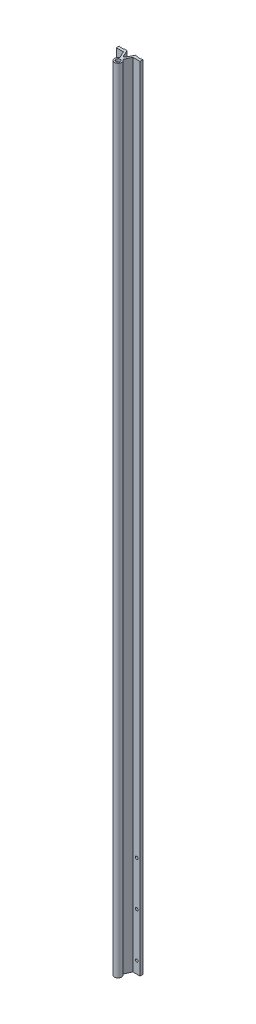
ISO-10303-21;
HEADER;
FILE_DESCRIPTION(('STEP AP214'),'2;1');
FILE_NAME('part.step','',(''),(''),'','','');
FILE_SCHEMA(('AUTOMOTIVE_DESIGN { 1 0 10303 214 1 1 1 1 }'));
ENDSEC;
DATA;
#1=APPLICATION_CONTEXT('core data for automotive mechanical design processes');
#2=APPLICATION_PROTOCOL_DEFINITION('international standard','automotive_design',2000,#1);
#3=PRODUCT_CONTEXT('',#1,'mechanical');
#4=PRODUCT('Part','Part','',(#3));
#5=PRODUCT_RELATED_PRODUCT_CATEGORY('part','',(#4));
#6=PRODUCT_DEFINITION_FORMATION('','',#4);
#7=PRODUCT_DEFINITION_CONTEXT('part definition',#1,'design');
#8=PRODUCT_DEFINITION('design','',#6,#7);
#9=PRODUCT_DEFINITION_SHAPE('','',#8);
#10=(LENGTH_UNIT() NAMED_UNIT(*) SI_UNIT(.MILLI.,.METRE.));
#11=(NAMED_UNIT(*) PLANE_ANGLE_UNIT() SI_UNIT($,.RADIAN.));
#12=(NAMED_UNIT(*) SI_UNIT($,.STERADIAN.) SOLID_ANGLE_UNIT());
#13=UNCERTAINTY_MEASURE_WITH_UNIT(LENGTH_MEASURE(1.E-05),#10,'distance_accuracy_value','');
#14=(GEOMETRIC_REPRESENTATION_CONTEXT(3) GLOBAL_UNCERTAINTY_ASSIGNED_CONTEXT((#13)) GLOBAL_UNIT_ASSIGNED_CONTEXT((#10,
#11,#12)) REPRESENTATION_CONTEXT('',''));
#15=CARTESIAN_POINT('',(0.,0.,0.));
#16=DIRECTION('',(0.,0.,1.));
#17=DIRECTION('',(1.,0.,0.));
#18=AXIS2_PLACEMENT_3D('',#15,#16,#17);
#19=CARTESIAN_POINT('',(0.,0.,-22.));
#20=DIRECTION('',(0.,0.,-1.));
#21=DIRECTION('',(-1.,0.,0.));
#22=AXIS2_PLACEMENT_3D('',#19,#20,#21);
#23=PLANE('',#22);
#24=DIRECTION('',(0.,1.,0.));
#25=VECTOR('',#24,1.);
#26=CARTESIAN_POINT('',(-20.,0.,-22.));
#27=LINE('',#26,#25);
#28=CARTESIAN_POINT('',(-20.,1146.,-22.));
#29=VERTEX_POINT('',#28);
#30=CARTESIAN_POINT('',(-20.,-190.,-22.));
#31=VERTEX_POINT('',#30);
#32=EDGE_CURVE('E212',#29,#31,#27,.F.);
#33=ORIENTED_EDGE('',*,*,#32,.F.);
#34=DIRECTION('',(1.,0.,0.));
#35=VECTOR('',#34,1.);
#36=CARTESIAN_POINT('',(-18.35,1146.,-22.));
#37=LINE('',#36,#35);
#38=CARTESIAN_POINT('',(-18.35,1146.,-22.));
#39=VERTEX_POINT('',#38);
#40=EDGE_CURVE('E884',#29,#39,#37,.T.);
#41=ORIENTED_EDGE('',*,*,#40,.T.);
#42=DIRECTION('',(0.,1.,0.));
#43=VECTOR('',#42,1.);
#44=CARTESIAN_POINT('',(-18.35,0.,-22.));
#45=LINE('',#44,#43);
#46=CARTESIAN_POINT('',(-18.35,-190.,-22.));
#47=VERTEX_POINT('',#46);
#48=EDGE_CURVE('E244',#39,#47,#45,.F.);
#49=ORIENTED_EDGE('',*,*,#48,.T.);
#50=DIRECTION('',(-1.,0.,0.));
#51=VECTOR('',#50,1.);
#52=CARTESIAN_POINT('',(0.,-190.,-22.));
#53=LINE('',#52,#51);
#54=EDGE_CURVE('E247',#47,#31,#53,.T.);
#55=ORIENTED_EDGE('',*,*,#54,.T.);
#56=EDGE_LOOP('',(#33,#41,#49,#55));
#57=FACE_BOUND('',#56,.T.);
#58=ADVANCED_FACE('F37',(#57),#23,.T.);
#59=CARTESIAN_POINT('',(-14.5,-170.,-19.5));
#60=DIRECTION('',(0.,0.,-1.));
#61=DIRECTION('',(-1.,0.,0.));
#62=AXIS2_PLACEMENT_3D('',#59,#60,#61);
#63=CYLINDRICAL_SURFACE('',#62,2.25);
#64=CARTESIAN_POINT('',(-14.5,-170.,-21.2));
#65=DIRECTION('',(0.,0.,-1.));
#66=DIRECTION('',(-1.,0.,0.));
#67=AXIS2_PLACEMENT_3D('',#64,#65,#66);
#68=CIRCLE('',#67,2.25);
#69=CARTESIAN_POINT('',(-16.75,-170.,-21.2));
#70=VERTEX_POINT('',#69);
#71=EDGE_CURVE('E215',#70,#70,#68,.T.);
#72=ORIENTED_EDGE('',*,*,#71,.T.);
#73=EDGE_LOOP('',(#72));
#74=FACE_BOUND('',#73,.T.);
#75=CARTESIAN_POINT('',(-14.5,-170.,-17.));
#76=DIRECTION('',(0.,0.,-1.));
#77=DIRECTION('',(-1.,0.,0.));
#78=AXIS2_PLACEMENT_3D('',#75,#76,#77);
#79=CIRCLE('',#78,2.25);
#80=CARTESIAN_POINT('',(-16.75,-170.,-17.));
#81=VERTEX_POINT('',#80);
#82=EDGE_CURVE('E40',#81,#81,#79,.T.);
#83=ORIENTED_EDGE('',*,*,#82,.F.);
#84=EDGE_LOOP('',(#83));
#85=FACE_BOUND('',#84,.T.);
#86=ADVANCED_FACE('F309',(#74,#85),#63,.F.);
#87=CARTESIAN_POINT('',(-14.5,-95.,-19.5));
#88=DIRECTION('',(0.,0.,-1.));
#89=DIRECTION('',(-1.,0.,0.));
#90=AXIS2_PLACEMENT_3D('',#87,#88,#89);
#91=CYLINDRICAL_SURFACE('',#90,2.25);
#92=CARTESIAN_POINT('',(-14.5,-95.,-21.2));
#93=DIRECTION('',(0.,0.,-1.));
#94=DIRECTION('',(-1.,0.,0.));
#95=AXIS2_PLACEMENT_3D('',#92,#93,#94);
#96=CIRCLE('',#95,2.25);
#97=CARTESIAN_POINT('',(-16.75,-95.,-21.2));
#98=VERTEX_POINT('',#97);
#99=EDGE_CURVE('E294',#98,#98,#96,.T.);
#100=ORIENTED_EDGE('',*,*,#99,.T.);
#101=EDGE_LOOP('',(#100));
#102=FACE_BOUND('',#101,.T.);
#103=CARTESIAN_POINT('',(-14.5,-95.,-17.));
#104=DIRECTION('',(0.,0.,-1.));
#105=DIRECTION('',(-1.,0.,0.));
#106=AXIS2_PLACEMENT_3D('',#103,#104,#105);
#107=CIRCLE('',#106,2.25);
#108=CARTESIAN_POINT('',(-16.75,-95.,-17.));
#109=VERTEX_POINT('',#108);
#110=EDGE_CURVE('E300',#109,#109,#107,.T.);
#111=ORIENTED_EDGE('',*,*,#110,.F.);
#112=EDGE_LOOP('',(#111));
#113=FACE_BOUND('',#112,.T.);
#114=ADVANCED_FACE('F311',(#102,#113),#91,.F.);
#115=CARTESIAN_POINT('',(-14.5,-20.,-19.5));
#116=DIRECTION('',(0.,0.,-1.));
#117=DIRECTION('',(-1.,0.,0.));
#118=AXIS2_PLACEMENT_3D('',#115,#116,#117);
#119=CYLINDRICAL_SURFACE('',#118,2.25);
#120=CARTESIAN_POINT('',(-14.5,-20.,-21.2));
#121=DIRECTION('',(0.,0.,-1.));
#122=DIRECTION('',(-1.,0.,0.));
#123=AXIS2_PLACEMENT_3D('',#120,#121,#122);
#124=CIRCLE('',#123,2.25);
#125=CARTESIAN_POINT('',(-16.75,-20.,-21.2));
#126=VERTEX_POINT('',#125);
#127=EDGE_CURVE('E265',#126,#126,#124,.T.);
#128=ORIENTED_EDGE('',*,*,#127,.T.);
#129=EDGE_LOOP('',(#128));
#130=FACE_BOUND('',#129,.T.);
#131=CARTESIAN_POINT('',(-14.5,-20.,-17.));
#132=DIRECTION('',(0.,0.,-1.));
#133=DIRECTION('',(-1.,0.,0.));
#134=AXIS2_PLACEMENT_3D('',#131,#132,#133);
#135=CIRCLE('',#134,2.25);
#136=CARTESIAN_POINT('',(-16.75,-20.,-17.));
#137=VERTEX_POINT('',#136);
#138=EDGE_CURVE('E229',#137,#137,#135,.T.);
#139=ORIENTED_EDGE('',*,*,#138,.F.);
#140=EDGE_LOOP('',(#139));
#141=FACE_BOUND('',#140,.T.);
#142=ADVANCED_FACE('F317',(#130,#141),#119,.F.);
#143=CARTESIAN_POINT('',(-18.35,0.,-22.));
#144=DIRECTION('',(-0.707106781186548,0.,0.707106781186548));
#145=DIRECTION('',(0.707106781186548,0.,0.707106781186548));
#146=AXIS2_PLACEMENT_3D('',#143,#144,#145);
#147=PLANE('',#146);
#148=ORIENTED_EDGE('',*,*,#48,.F.);
#149=DIRECTION('',(0.707106781186549,0.,0.707106781186546));
#150=VECTOR('',#149,1.);
#151=CARTESIAN_POINT('',(-17.55,1146.,-21.2));
#152=LINE('',#151,#150);
#153=CARTESIAN_POINT('',(-17.55,1146.,-21.2));
#154=VERTEX_POINT('',#153);
#155=EDGE_CURVE('E876',#39,#154,#152,.T.);
#156=ORIENTED_EDGE('',*,*,#155,.T.);
#157=DIRECTION('',(0.,1.,0.));
#158=VECTOR('',#157,1.);
#159=CARTESIAN_POINT('',(-17.55,0.,-21.2));
#160=LINE('',#159,#158);
#161=CARTESIAN_POINT('',(-17.55,-190.,-21.2));
#162=VERTEX_POINT('',#161);
#163=EDGE_CURVE('E207',#154,#162,#160,.F.);
#164=ORIENTED_EDGE('',*,*,#163,.T.);
#165=DIRECTION('',(0.707106781186548,0.,0.707106781186548));
#166=VECTOR('',#165,1.);
#167=CARTESIAN_POINT('',(-18.35,-190.,-22.));
#168=LINE('',#167,#166);
#169=EDGE_CURVE('E116',#47,#162,#168,.T.);
#170=ORIENTED_EDGE('',*,*,#169,.F.);
#171=EDGE_LOOP('',(#148,#156,#164,#170));
#172=FACE_BOUND('',#171,.T.);
#173=ADVANCED_FACE('F409',(#172),#147,.F.);
#174=CARTESIAN_POINT('',(-11.45,0.,-21.2));
#175=DIRECTION('',(0.707106781186548,0.,0.707106781186548));
#176=DIRECTION('',(0.707106781186548,0.,-0.707106781186548));
#177=AXIS2_PLACEMENT_3D('',#174,#175,#176);
#178=PLANE('',#177);
#179=DIRECTION('',(0.,1.,0.));
#180=VECTOR('',#179,1.);
#181=CARTESIAN_POINT('',(-11.45,0.,-21.2));
#182=LINE('',#181,#180);
#183=CARTESIAN_POINT('',(-11.45,-190.,-21.2));
#184=VERTEX_POINT('',#183);
#185=CARTESIAN_POINT('',(-11.45,1146.,-21.2));
#186=VERTEX_POINT('',#185);
#187=EDGE_CURVE('E211',#184,#186,#182,.T.);
#188=ORIENTED_EDGE('',*,*,#187,.T.);
#189=DIRECTION('',(0.707106781186547,0.,-0.707106781186548));
#190=VECTOR('',#189,1.);
#191=CARTESIAN_POINT('',(-10.65,1146.,-22.));
#192=LINE('',#191,#190);
#193=CARTESIAN_POINT('',(-10.65,1146.,-22.));
#194=VERTEX_POINT('',#193);
#195=EDGE_CURVE('E968',#186,#194,#192,.T.);
#196=ORIENTED_EDGE('',*,*,#195,.T.);
#197=DIRECTION('',(0.,1.,0.));
#198=VECTOR('',#197,1.);
#199=CARTESIAN_POINT('',(-10.65,0.,-22.));
#200=LINE('',#199,#198);
#201=CARTESIAN_POINT('',(-10.65,-190.,-22.));
#202=VERTEX_POINT('',#201);
#203=EDGE_CURVE('E195',#202,#194,#200,.T.);
#204=ORIENTED_EDGE('',*,*,#203,.F.);
#205=DIRECTION('',(0.707106781186548,0.,-0.707106781186548));
#206=VECTOR('',#205,1.);
#207=CARTESIAN_POINT('',(-11.45,-190.,-21.2));
#208=LINE('',#207,#206);
#209=EDGE_CURVE('E108',#184,#202,#208,.T.);
#210=ORIENTED_EDGE('',*,*,#209,.F.);
#211=EDGE_LOOP('',(#188,#196,#204,#210));
#212=FACE_BOUND('',#211,.T.);
#213=ADVANCED_FACE('F405',(#212),#178,.F.);
#214=CARTESIAN_POINT('',(17.55,0.,-21.2));
#215=DIRECTION('',(0.707106781186548,0.,0.707106781186548));
#216=DIRECTION('',(0.707106781186548,0.,-0.707106781186548));
#217=AXIS2_PLACEMENT_3D('',#214,#215,#216);
#218=PLANE('',#217);
#219=DIRECTION('',(0.,1.,0.));
#220=VECTOR('',#219,1.);
#221=CARTESIAN_POINT('',(17.55,0.,-21.2));
#222=LINE('',#221,#220);
#223=CARTESIAN_POINT('',(17.55,-190.,-21.2));
#224=VERTEX_POINT('',#223);
#225=CARTESIAN_POINT('',(17.55,1146.,-21.2));
#226=VERTEX_POINT('',#225);
#227=EDGE_CURVE('E176',#224,#226,#222,.T.);
#228=ORIENTED_EDGE('',*,*,#227,.T.);
#229=DIRECTION('',(0.707106781186548,0.,-0.707106781186548));
#230=VECTOR('',#229,1.);
#231=CARTESIAN_POINT('',(18.35,1146.,-22.));
#232=LINE('',#231,#230);
#233=CARTESIAN_POINT('',(18.35,1146.,-22.));
#234=VERTEX_POINT('',#233);
#235=EDGE_CURVE('E946',#226,#234,#232,.T.);
#236=ORIENTED_EDGE('',*,*,#235,.T.);
#237=DIRECTION('',(0.,1.,0.));
#238=VECTOR('',#237,1.);
#239=CARTESIAN_POINT('',(18.35,0.,-22.));
#240=LINE('',#239,#238);
#241=CARTESIAN_POINT('',(18.35,-190.,-22.));
#242=VERTEX_POINT('',#241);
#243=EDGE_CURVE('E233',#242,#234,#240,.T.);
#244=ORIENTED_EDGE('',*,*,#243,.F.);
#245=DIRECTION('',(0.707106781186548,0.,-0.707106781186548));
#246=VECTOR('',#245,1.);
#247=CARTESIAN_POINT('',(17.55,-190.,-21.2));
#248=LINE('',#247,#246);
#249=EDGE_CURVE('E239',#224,#242,#248,.T.);
#250=ORIENTED_EDGE('',*,*,#249,.F.);
#251=EDGE_LOOP('',(#228,#236,#244,#250));
#252=FACE_BOUND('',#251,.T.);
#253=ADVANCED_FACE('F401',(#252),#218,.F.);
#254=CARTESIAN_POINT('',(10.65,0.,-22.));
#255=DIRECTION('',(-0.707106781186548,0.,0.707106781186548));
#256=DIRECTION('',(0.707106781186548,0.,0.707106781186548));
#257=AXIS2_PLACEMENT_3D('',#254,#255,#256);
#258=PLANE('',#257);
#259=DIRECTION('',(0.,1.,0.));
#260=VECTOR('',#259,1.);
#261=CARTESIAN_POINT('',(10.65,0.,-22.));
#262=LINE('',#261,#260);
#263=CARTESIAN_POINT('',(10.65,1146.,-22.));
#264=VERTEX_POINT('',#263);
#265=CARTESIAN_POINT('',(10.65,-190.,-22.));
#266=VERTEX_POINT('',#265);
#267=EDGE_CURVE('E177',#264,#266,#262,.F.);
#268=ORIENTED_EDGE('',*,*,#267,.F.);
#269=DIRECTION('',(0.707106781186548,0.,0.707106781186548));
#270=VECTOR('',#269,1.);
#271=CARTESIAN_POINT('',(11.45,1146.,-21.2));
#272=LINE('',#271,#270);
#273=CARTESIAN_POINT('',(11.45,1146.,-21.2));
#274=VERTEX_POINT('',#273);
#275=EDGE_CURVE('E952',#264,#274,#272,.T.);
#276=ORIENTED_EDGE('',*,*,#275,.T.);
#277=DIRECTION('',(0.,1.,0.));
#278=VECTOR('',#277,1.);
#279=CARTESIAN_POINT('',(11.45,0.,-21.2));
#280=LINE('',#279,#278);
#281=CARTESIAN_POINT('',(11.45,-190.,-21.2));
#282=VERTEX_POINT('',#281);
#283=EDGE_CURVE('E171',#274,#282,#280,.F.);
#284=ORIENTED_EDGE('',*,*,#283,.T.);
#285=DIRECTION('',(0.707106781186548,0.,0.707106781186548));
#286=VECTOR('',#285,1.);
#287=CARTESIAN_POINT('',(10.65,-190.,-22.));
#288=LINE('',#287,#286);
#289=EDGE_CURVE('E236',#266,#282,#288,.T.);
#290=ORIENTED_EDGE('',*,*,#289,.F.);
#291=EDGE_LOOP('',(#268,#276,#284,#290));
#292=FACE_BOUND('',#291,.T.);
#293=ADVANCED_FACE('F397',(#292),#258,.F.);
#294=CARTESIAN_POINT('',(0.,0.,-22.));
#295=DIRECTION('',(0.,0.,-1.));
#296=DIRECTION('',(-1.,0.,0.));
#297=AXIS2_PLACEMENT_3D('',#294,#295,#296);
#298=PLANE('',#297);
#299=DIRECTION('',(0.,1.,0.));
#300=VECTOR('',#299,1.);
#301=CARTESIAN_POINT('',(20.,0.,-22.));
#302=LINE('',#301,#300);
#303=CARTESIAN_POINT('',(20.,-190.,-22.));
#304=VERTEX_POINT('',#303);
#305=CARTESIAN_POINT('',(20.,1146.,-22.));
#306=VERTEX_POINT('',#305);
#307=EDGE_CURVE('E168',#304,#306,#302,.T.);
#308=ORIENTED_EDGE('',*,*,#307,.F.);
#309=DIRECTION('',(-1.,0.,0.));
#310=VECTOR('',#309,1.);
#311=CARTESIAN_POINT('',(0.,-190.,-22.));
#312=LINE('',#311,#310);
#313=EDGE_CURVE('E156',#304,#242,#312,.T.);
#314=ORIENTED_EDGE('',*,*,#313,.T.);
#315=ORIENTED_EDGE('',*,*,#243,.T.);
#316=DIRECTION('',(1.,0.,0.));
#317=VECTOR('',#316,1.);
#318=CARTESIAN_POINT('',(20.,1146.,-22.));
#319=LINE('',#318,#317);
#320=EDGE_CURVE('E941',#234,#306,#319,.T.);
#321=ORIENTED_EDGE('',*,*,#320,.T.);
#322=EDGE_LOOP('',(#308,#314,#315,#321));
#323=FACE_BOUND('',#322,.T.);
#324=ADVANCED_FACE('F393',(#323),#298,.T.);
#325=CARTESIAN_POINT('',(14.5,-170.,-19.5));
#326=DIRECTION('',(0.,0.,-1.));
#327=DIRECTION('',(-1.,0.,0.));
#328=AXIS2_PLACEMENT_3D('',#325,#326,#327);
#329=CYLINDRICAL_SURFACE('',#328,2.25);
#330=CARTESIAN_POINT('',(14.5,-170.,-17.));
#331=DIRECTION('',(0.,0.,-1.));
#332=DIRECTION('',(-1.,0.,0.));
#333=AXIS2_PLACEMENT_3D('',#330,#331,#332);
#334=CIRCLE('',#333,2.25);
#335=CARTESIAN_POINT('',(12.25,-170.,-17.));
#336=VERTEX_POINT('',#335);
#337=EDGE_CURVE('E170',#336,#336,#334,.T.);
#338=ORIENTED_EDGE('',*,*,#337,.F.);
#339=EDGE_LOOP('',(#338));
#340=FACE_BOUND('',#339,.T.);
#341=CARTESIAN_POINT('',(14.5,-170.,-21.2));
#342=DIRECTION('',(0.,0.,-1.));
#343=DIRECTION('',(-1.,0.,0.));
#344=AXIS2_PLACEMENT_3D('',#341,#342,#343);
#345=CIRCLE('',#344,2.25);
#346=CARTESIAN_POINT('',(12.25,-170.,-21.2));
#347=VERTEX_POINT('',#346);
#348=EDGE_CURVE('E190',#347,#347,#345,.T.);
#349=ORIENTED_EDGE('',*,*,#348,.T.);
#350=EDGE_LOOP('',(#349));
#351=FACE_BOUND('',#350,.T.);
#352=ADVANCED_FACE('F389',(#340,#351),#329,.F.);
#353=CARTESIAN_POINT('',(14.5,-95.,-19.5));
#354=DIRECTION('',(0.,0.,-1.));
#355=DIRECTION('',(-1.,0.,0.));
#356=AXIS2_PLACEMENT_3D('',#353,#354,#355);
#357=CYLINDRICAL_SURFACE('',#356,2.25);
#358=CARTESIAN_POINT('',(14.5,-95.,-17.));
#359=DIRECTION('',(0.,0.,-1.));
#360=DIRECTION('',(-1.,0.,0.));
#361=AXIS2_PLACEMENT_3D('',#358,#359,#360);
#362=CIRCLE('',#361,2.25);
#363=CARTESIAN_POINT('',(12.25,-95.,-17.));
#364=VERTEX_POINT('',#363);
#365=EDGE_CURVE('E280',#364,#364,#362,.T.);
#366=ORIENTED_EDGE('',*,*,#365,.F.);
#367=EDGE_LOOP('',(#366));
#368=FACE_BOUND('',#367,.T.);
#369=CARTESIAN_POINT('',(14.5,-95.,-21.2));
#370=DIRECTION('',(0.,0.,-1.));
#371=DIRECTION('',(-1.,0.,0.));
#372=AXIS2_PLACEMENT_3D('',#369,#370,#371);
#373=CIRCLE('',#372,2.25);
#374=CARTESIAN_POINT('',(12.25,-95.,-21.2));
#375=VERTEX_POINT('',#374);
#376=EDGE_CURVE('E287',#375,#375,#373,.T.);
#377=ORIENTED_EDGE('',*,*,#376,.T.);
#378=EDGE_LOOP('',(#377));
#379=FACE_BOUND('',#378,.T.);
#380=ADVANCED_FACE('F385',(#368,#379),#357,.F.);
#381=CARTESIAN_POINT('',(14.5,-20.,-19.5));
#382=DIRECTION('',(0.,0.,-1.));
#383=DIRECTION('',(-1.,0.,0.));
#384=AXIS2_PLACEMENT_3D('',#381,#382,#383);
#385=CYLINDRICAL_SURFACE('',#384,2.25);
#386=CARTESIAN_POINT('',(14.5,-20.,-17.));
#387=DIRECTION('',(0.,0.,-1.));
#388=DIRECTION('',(-1.,0.,0.));
#389=AXIS2_PLACEMENT_3D('',#386,#387,#388);
#390=CIRCLE('',#389,2.25);
#391=CARTESIAN_POINT('',(12.25,-20.,-17.));
#392=VERTEX_POINT('',#391);
#393=EDGE_CURVE('E143',#392,#392,#390,.T.);
#394=ORIENTED_EDGE('',*,*,#393,.F.);
#395=EDGE_LOOP('',(#394));
#396=FACE_BOUND('',#395,.T.);
#397=CARTESIAN_POINT('',(14.5,-20.,-21.2));
#398=DIRECTION('',(0.,0.,-1.));
#399=DIRECTION('',(-1.,0.,0.));
#400=AXIS2_PLACEMENT_3D('',#397,#398,#399);
#401=CIRCLE('',#400,2.25);
#402=CARTESIAN_POINT('',(12.25,-20.,-21.2));
#403=VERTEX_POINT('',#402);
#404=EDGE_CURVE('E259',#403,#403,#401,.T.);
#405=ORIENTED_EDGE('',*,*,#404,.T.);
#406=EDGE_LOOP('',(#405));
#407=FACE_BOUND('',#406,.T.);
#408=ADVANCED_FACE('F381',(#396,#407),#385,.F.);
#409=CARTESIAN_POINT('',(0.,-95.,0.));
#410=DIRECTION('',(0.,-1.,0.));
#411=DIRECTION('',(0.,0.,-1.));
#412=AXIS2_PLACEMENT_3D('',#409,#410,#411);
#413=CYLINDRICAL_SURFACE('',#412,3.5);
#414=CARTESIAN_POINT('',(0.,-190.,0.));
#415=DIRECTION('',(0.,-1.,0.));
#416=DIRECTION('',(0.,0.,-1.));
#417=AXIS2_PLACEMENT_3D('',#414,#415,#416);
#418=CIRCLE('',#417,3.5);
#419=CARTESIAN_POINT('',(0.,-190.,-3.5));
#420=VERTEX_POINT('',#419);
#421=EDGE_CURVE('E274',#420,#420,#418,.F.);
#422=ORIENTED_EDGE('',*,*,#421,.F.);
#423=EDGE_LOOP('',(#422));
#424=FACE_BOUND('',#423,.T.);
#425=CARTESIAN_POINT('',(0.,1146.,0.));
#426=DIRECTION('',(0.,-1.,0.));
#427=DIRECTION('',(0.,0.,-1.));
#428=AXIS2_PLACEMENT_3D('',#425,#426,#427);
#429=CIRCLE('',#428,3.5);
#430=CARTESIAN_POINT('',(0.,1146.,-3.5));
#431=VERTEX_POINT('',#430);
#432=EDGE_CURVE('E249',#431,#431,#429,.T.);
#433=ORIENTED_EDGE('',*,*,#432,.F.);
#434=EDGE_LOOP('',(#433));
#435=FACE_BOUND('',#434,.T.);
#436=ADVANCED_FACE('F377',(#424,#435),#413,.F.);
#437=CARTESIAN_POINT('',(-7.92723018863498,0.,-17.));
#438=DIRECTION('',(-0.90630778703665,0.,0.4226182617407));
#439=DIRECTION('',(0.4226182617407,0.,0.90630778703665));
#440=AXIS2_PLACEMENT_3D('',#437,#438,#439);
#441=PLANE('',#440);
#442=DIRECTION('',(0.,1.,0.));
#443=VECTOR('',#442,1.);
#444=CARTESIAN_POINT('',(-7.92723018863498,0.,-17.));
#445=LINE('',#444,#443);
#446=CARTESIAN_POINT('',(-7.92723018863498,-190.,-17.));
#447=VERTEX_POINT('',#446);
#448=CARTESIAN_POINT('',(-7.92723018863498,1146.,-17.));
#449=VERTEX_POINT('',#448);
#450=EDGE_CURVE('E219',#447,#449,#445,.T.);
#451=ORIENTED_EDGE('',*,*,#450,.F.);
#452=DIRECTION('',(-0.422618261740699,0.,-0.90630778703665));
#453=VECTOR('',#452,1.);
#454=CARTESIAN_POINT('',(-2.5357095704442,-190.,-5.4378467222199));
#455=LINE('',#454,#453);
#456=CARTESIAN_POINT('',(-2.5357095704442,-190.,-5.4378467222199));
#457=VERTEX_POINT('',#456);
#458=EDGE_CURVE('E224',#457,#447,#455,.T.);
#459=ORIENTED_EDGE('',*,*,#458,.F.);
#460=DIRECTION('',(0.,1.,0.));
#461=VECTOR('',#460,1.);
#462=CARTESIAN_POINT('',(-2.5357095704442,-95.,-5.4378467222199));
#463=LINE('',#462,#461);
#464=CARTESIAN_POINT('',(-2.5357095704442,1146.,-5.4378467222199));
#465=VERTEX_POINT('',#464);
#466=EDGE_CURVE('E277',#465,#457,#463,.F.);
#467=ORIENTED_EDGE('',*,*,#466,.F.);
#468=DIRECTION('',(-0.4226182617407,0.,-0.90630778703665));
#469=VECTOR('',#468,1.);
#470=CARTESIAN_POINT('',(-7.92723018863498,1146.,-17.));
#471=LINE('',#470,#469);
#472=EDGE_CURVE('E899',#465,#449,#471,.T.);
#473=ORIENTED_EDGE('',*,*,#472,.T.);
#474=EDGE_LOOP('',(#451,#459,#467,#473));
#475=FACE_BOUND('',#474,.T.);
#476=ADVANCED_FACE('F373',(#475),#441,.T.);
#477=CARTESIAN_POINT('',(-20.,0.,-17.));
#478=DIRECTION('',(0.,0.,1.));
#479=DIRECTION('',(1.,0.,0.));
#480=AXIS2_PLACEMENT_3D('',#477,#478,#479);
#481=PLANE('',#480);
#482=ORIENTED_EDGE('',*,*,#450,.T.);
#483=DIRECTION('',(-1.,0.,0.));
#484=VECTOR('',#483,1.);
#485=CARTESIAN_POINT('',(-20.,1146.,-17.));
#486=LINE('',#485,#484);
#487=CARTESIAN_POINT('',(-20.,1146.,-17.));
#488=VERTEX_POINT('',#487);
#489=EDGE_CURVE('E893',#449,#488,#486,.T.);
#490=ORIENTED_EDGE('',*,*,#489,.T.);
#491=DIRECTION('',(0.,1.,0.));
#492=VECTOR('',#491,1.);
#493=CARTESIAN_POINT('',(-20.,0.,-17.));
#494=LINE('',#493,#492);
#495=CARTESIAN_POINT('',(-20.,-190.,-17.));
#496=VERTEX_POINT('',#495);
#497=EDGE_CURVE('E216',#496,#488,#494,.T.);
#498=ORIENTED_EDGE('',*,*,#497,.F.);
#499=DIRECTION('',(1.,0.,0.));
#500=VECTOR('',#499,1.);
#501=CARTESIAN_POINT('',(0.,-190.,-17.));
#502=LINE('',#501,#500);
#503=EDGE_CURVE('E220',#447,#496,#502,.F.);
#504=ORIENTED_EDGE('',*,*,#503,.F.);
#505=EDGE_LOOP('',(#482,#490,#498,#504));
#506=FACE_BOUND('',#505,.T.);
#507=ORIENTED_EDGE('',*,*,#138,.T.);
#508=EDGE_LOOP('',(#507));
#509=FACE_BOUND('',#508,.T.);
#510=ORIENTED_EDGE('',*,*,#110,.T.);
#511=EDGE_LOOP('',(#510));
#512=FACE_BOUND('',#511,.T.);
#513=ORIENTED_EDGE('',*,*,#82,.T.);
#514=EDGE_LOOP('',(#513));
#515=FACE_BOUND('',#514,.T.);
#516=ADVANCED_FACE('F307',(#506,#509,#512,#515),#481,.T.);
#517=CARTESIAN_POINT('',(-20.,0.,-22.));
#518=DIRECTION('',(-1.,0.,0.));
#519=DIRECTION('',(0.,0.,1.));
#520=AXIS2_PLACEMENT_3D('',#517,#518,#519);
#521=PLANE('',#520);
#522=ORIENTED_EDGE('',*,*,#497,.T.);
#523=DIRECTION('',(0.,0.,-1.));
#524=VECTOR('',#523,1.);
#525=CARTESIAN_POINT('',(-20.,1146.,-22.));
#526=LINE('',#525,#524);
#527=EDGE_CURVE('E891',#488,#29,#526,.T.);
#528=ORIENTED_EDGE('',*,*,#527,.T.);
#529=ORIENTED_EDGE('',*,*,#32,.T.);
#530=DIRECTION('',(0.,0.,-1.));
#531=VECTOR('',#530,1.);
#532=CARTESIAN_POINT('',(-20.,-190.,-16.1592701804792));
#533=LINE('',#532,#531);
#534=EDGE_CURVE('E223',#496,#31,#533,.T.);
#535=ORIENTED_EDGE('',*,*,#534,.F.);
#536=EDGE_LOOP('',(#522,#528,#529,#535));
#537=FACE_BOUND('',#536,.T.);
#538=ADVANCED_FACE('F366',(#537),#521,.T.);
#539=CARTESIAN_POINT('',(-17.55,0.,-21.2));
#540=DIRECTION('',(0.,0.,1.));
#541=DIRECTION('',(1.,0.,0.));
#542=AXIS2_PLACEMENT_3D('',#539,#540,#541);
#543=PLANE('',#542);
#544=ORIENTED_EDGE('',*,*,#163,.F.);
#545=DIRECTION('',(1.,0.,0.));
#546=VECTOR('',#545,1.);
#547=CARTESIAN_POINT('',(-11.45,1146.,-21.2));
#548=LINE('',#547,#546);
#549=EDGE_CURVE('E888',#154,#186,#548,.T.);
#550=ORIENTED_EDGE('',*,*,#549,.T.);
#551=ORIENTED_EDGE('',*,*,#187,.F.);
#552=DIRECTION('',(1.,0.,0.));
#553=VECTOR('',#552,1.);
#554=CARTESIAN_POINT('',(0.,-190.,-21.2));
#555=LINE('',#554,#553);
#556=EDGE_CURVE('E202',#162,#184,#555,.T.);
#557=ORIENTED_EDGE('',*,*,#556,.F.);
#558=EDGE_LOOP('',(#544,#550,#551,#557));
#559=FACE_BOUND('',#558,.T.);
#560=ORIENTED_EDGE('',*,*,#127,.F.);
#561=EDGE_LOOP('',(#560));
#562=FACE_BOUND('',#561,.T.);
#563=ORIENTED_EDGE('',*,*,#99,.F.);
#564=EDGE_LOOP('',(#563));
#565=FACE_BOUND('',#564,.T.);
#566=ORIENTED_EDGE('',*,*,#71,.F.);
#567=EDGE_LOOP('',(#566));
#568=FACE_BOUND('',#567,.T.);
#569=ADVANCED_FACE('F363',(#559,#562,#565,#568),#543,.F.);
#570=CARTESIAN_POINT('',(0.,0.,-22.));
#571=DIRECTION('',(0.,0.,-1.));
#572=DIRECTION('',(-1.,0.,0.));
#573=AXIS2_PLACEMENT_3D('',#570,#571,#572);
#574=PLANE('',#573);
#575=DIRECTION('',(0.,1.,0.));
#576=VECTOR('',#575,1.);
#577=CARTESIAN_POINT('',(-6.83917898627331,0.,-22.));
#578=LINE('',#577,#576);
#579=CARTESIAN_POINT('',(-6.83917898627331,1146.,-22.));
#580=VERTEX_POINT('',#579);
#581=CARTESIAN_POINT('',(-6.83917898627331,-190.,-22.));
#582=VERTEX_POINT('',#581);
#583=EDGE_CURVE('E79',#580,#582,#578,.F.);
#584=ORIENTED_EDGE('',*,*,#583,.T.);
#585=DIRECTION('',(1.,0.,0.));
#586=VECTOR('',#585,1.);
#587=CARTESIAN_POINT('',(0.,-190.,-22.));
#588=LINE('',#587,#586);
#589=EDGE_CURVE('E198',#202,#582,#588,.T.);
#590=ORIENTED_EDGE('',*,*,#589,.F.);
#591=ORIENTED_EDGE('',*,*,#203,.T.);
#592=DIRECTION('',(1.,0.,0.));
#593=VECTOR('',#592,1.);
#594=CARTESIAN_POINT('',(-6.83917898627331,1146.,-22.));
#595=LINE('',#594,#593);
#596=EDGE_CURVE('E966',#194,#580,#595,.T.);
#597=ORIENTED_EDGE('',*,*,#596,.T.);
#598=EDGE_LOOP('',(#584,#590,#591,#597));
#599=FACE_BOUND('',#598,.T.);
#600=ADVANCED_FACE('F360',(#599),#574,.T.);
#601=CARTESIAN_POINT('',(-4.50764069549832,0.,-17.));
#602=DIRECTION('',(-0.90630778703665,0.,0.4226182617407));
#603=DIRECTION('',(0.4226182617407,0.,0.90630778703665));
#604=AXIS2_PLACEMENT_3D('',#601,#602,#603);
#605=PLANE('',#604);
#606=ORIENTED_EDGE('',*,*,#583,.F.);
#607=DIRECTION('',(0.422618261740699,0.,0.90630778703665));
#608=VECTOR('',#607,1.);
#609=CARTESIAN_POINT('',(-1.70979474656833,1146.,-11.));
#610=LINE('',#609,#608);
#611=CARTESIAN_POINT('',(-1.70979474656833,1146.,-11.));
#612=VERTEX_POINT('',#611);
#613=EDGE_CURVE('E964',#580,#612,#610,.T.);
#614=ORIENTED_EDGE('',*,*,#613,.T.);
#615=DIRECTION('',(0.,1.,0.));
#616=VECTOR('',#615,1.);
#617=CARTESIAN_POINT('',(-1.70979474656832,0.,-11.));
#618=LINE('',#617,#616);
#619=CARTESIAN_POINT('',(-1.70979474656833,-190.,-11.));
#620=VERTEX_POINT('',#619);
#621=EDGE_CURVE('E68',#612,#620,#618,.F.);
#622=ORIENTED_EDGE('',*,*,#621,.T.);
#623=DIRECTION('',(0.422618261740699,0.,0.90630778703665));
#624=VECTOR('',#623,1.);
#625=CARTESIAN_POINT('',(-6.83917898627331,-190.,-22.));
#626=LINE('',#625,#624);
#627=EDGE_CURVE('E201',#582,#620,#626,.T.);
#628=ORIENTED_EDGE('',*,*,#627,.F.);
#629=EDGE_LOOP('',(#606,#614,#622,#628));
#630=FACE_BOUND('',#629,.T.);
#631=ADVANCED_FACE('F356',(#630),#605,.F.);
#632=CARTESIAN_POINT('',(0.,0.,-11.797290384198));
#633=DIRECTION('',(0.,1.,0.));
#634=DIRECTION('',(0.,0.,1.));
#635=AXIS2_PLACEMENT_3D('',#632,#633,#634);
#636=CYLINDRICAL_SURFACE('',#635,1.88654976932156);
#637=ORIENTED_EDGE('',*,*,#621,.F.);
#638=CARTESIAN_POINT('',(0.,1146.,-11.797290384198));
#639=DIRECTION('',(0.,-1.,0.));
#640=DIRECTION('',(0.,0.,-1.));
#641=AXIS2_PLACEMENT_3D('',#638,#639,#640);
#642=CIRCLE('',#641,1.88654976932157);
#643=CARTESIAN_POINT('',(1.70979474656833,1146.,-11.));
#644=VERTEX_POINT('',#643);
#645=EDGE_CURVE('E961',#612,#644,#642,.F.);
#646=ORIENTED_EDGE('',*,*,#645,.T.);
#647=DIRECTION('',(0.,1.,0.));
#648=VECTOR('',#647,1.);
#649=CARTESIAN_POINT('',(1.70979474656833,0.,-11.));
#650=LINE('',#649,#648);
#651=CARTESIAN_POINT('',(1.70979474656833,-190.,-11.));
#652=VERTEX_POINT('',#651);
#653=EDGE_CURVE('E181',#644,#652,#650,.F.);
#654=ORIENTED_EDGE('',*,*,#653,.T.);
#655=CARTESIAN_POINT('',(0.,-190.,-11.797290384198));
#656=DIRECTION('',(0.,1.,0.));
#657=DIRECTION('',(0.,0.,1.));
#658=AXIS2_PLACEMENT_3D('',#655,#656,#657);
#659=CIRCLE('',#658,1.88654976932156);
#660=EDGE_CURVE('E271',#620,#652,#659,.T.);
#661=ORIENTED_EDGE('',*,*,#660,.F.);
#662=EDGE_LOOP('',(#637,#646,#654,#661));
#663=FACE_BOUND('',#662,.T.);
#664=ADVANCED_FACE('F352',(#663),#636,.F.);
#665=CARTESIAN_POINT('',(1.70979474656833,0.,-11.));
#666=DIRECTION('',(0.90630778703665,0.,0.4226182617407));
#667=DIRECTION('',(0.4226182617407,0.,-0.90630778703665));
#668=AXIS2_PLACEMENT_3D('',#665,#666,#667);
#669=PLANE('',#668);
#670=ORIENTED_EDGE('',*,*,#653,.F.);
#671=DIRECTION('',(0.422618261740699,0.,-0.90630778703665));
#672=VECTOR('',#671,1.);
#673=CARTESIAN_POINT('',(6.83917898627331,1146.,-22.));
#674=LINE('',#673,#672);
#675=CARTESIAN_POINT('',(6.83917898627331,1146.,-22.));
#676=VERTEX_POINT('',#675);
#677=EDGE_CURVE('E958',#644,#676,#674,.T.);
#678=ORIENTED_EDGE('',*,*,#677,.T.);
#679=DIRECTION('',(0.,1.,0.));
#680=VECTOR('',#679,1.);
#681=CARTESIAN_POINT('',(6.83917898627331,0.,-22.));
#682=LINE('',#681,#680);
#683=CARTESIAN_POINT('',(6.83917898627331,-190.,-22.));
#684=VERTEX_POINT('',#683);
#685=EDGE_CURVE('E180',#684,#676,#682,.T.);
#686=ORIENTED_EDGE('',*,*,#685,.F.);
#687=DIRECTION('',(0.422618261740699,0.,-0.90630778703665));
#688=VECTOR('',#687,1.);
#689=CARTESIAN_POINT('',(1.70979474656833,-190.,-11.));
#690=LINE('',#689,#688);
#691=EDGE_CURVE('E185',#652,#684,#690,.T.);
#692=ORIENTED_EDGE('',*,*,#691,.F.);
#693=EDGE_LOOP('',(#670,#678,#686,#692));
#694=FACE_BOUND('',#693,.T.);
#695=ADVANCED_FACE('F348',(#694),#669,.F.);
#696=CARTESIAN_POINT('',(0.,0.,-22.));
#697=DIRECTION('',(0.,0.,-1.));
#698=DIRECTION('',(-1.,0.,0.));
#699=AXIS2_PLACEMENT_3D('',#696,#697,#698);
#700=PLANE('',#699);
#701=ORIENTED_EDGE('',*,*,#685,.T.);
#702=DIRECTION('',(1.,0.,0.));
#703=VECTOR('',#702,1.);
#704=CARTESIAN_POINT('',(10.65,1146.,-22.));
#705=LINE('',#704,#703);
#706=EDGE_CURVE('E955',#676,#264,#705,.T.);
#707=ORIENTED_EDGE('',*,*,#706,.T.);
#708=ORIENTED_EDGE('',*,*,#267,.T.);
#709=DIRECTION('',(1.,0.,0.));
#710=VECTOR('',#709,1.);
#711=CARTESIAN_POINT('',(0.,-190.,-22.));
#712=LINE('',#711,#710);
#713=EDGE_CURVE('E161',#684,#266,#712,.T.);
#714=ORIENTED_EDGE('',*,*,#713,.F.);
#715=EDGE_LOOP('',(#701,#707,#708,#714));
#716=FACE_BOUND('',#715,.T.);
#717=ADVANCED_FACE('F344',(#716),#700,.T.);
#718=CARTESIAN_POINT('',(11.45,0.,-21.2));
#719=DIRECTION('',(0.,0.,1.));
#720=DIRECTION('',(1.,0.,0.));
#721=AXIS2_PLACEMENT_3D('',#718,#719,#720);
#722=PLANE('',#721);
#723=ORIENTED_EDGE('',*,*,#283,.F.);
#724=DIRECTION('',(1.,0.,0.));
#725=VECTOR('',#724,1.);
#726=CARTESIAN_POINT('',(17.55,1146.,-21.2));
#727=LINE('',#726,#725);
#728=EDGE_CURVE('E949',#274,#226,#727,.T.);
#729=ORIENTED_EDGE('',*,*,#728,.T.);
#730=ORIENTED_EDGE('',*,*,#227,.F.);
#731=DIRECTION('',(1.,0.,0.));
#732=VECTOR('',#731,1.);
#733=CARTESIAN_POINT('',(0.,-190.,-21.2));
#734=LINE('',#733,#732);
#735=EDGE_CURVE('E158',#282,#224,#734,.T.);
#736=ORIENTED_EDGE('',*,*,#735,.F.);
#737=EDGE_LOOP('',(#723,#729,#730,#736));
#738=FACE_BOUND('',#737,.T.);
#739=ORIENTED_EDGE('',*,*,#404,.F.);
#740=EDGE_LOOP('',(#739));
#741=FACE_BOUND('',#740,.T.);
#742=ORIENTED_EDGE('',*,*,#376,.F.);
#743=EDGE_LOOP('',(#742));
#744=FACE_BOUND('',#743,.T.);
#745=ORIENTED_EDGE('',*,*,#348,.F.);
#746=EDGE_LOOP('',(#745));
#747=FACE_BOUND('',#746,.T.);
#748=ADVANCED_FACE('F341',(#738,#741,#744,#747),#722,.F.);
#749=CARTESIAN_POINT('',(20.,0.,-17.));
#750=DIRECTION('',(1.,0.,0.));
#751=DIRECTION('',(0.,0.,-1.));
#752=AXIS2_PLACEMENT_3D('',#749,#750,#751);
#753=PLANE('',#752);
#754=ORIENTED_EDGE('',*,*,#307,.T.);
#755=DIRECTION('',(0.,0.,1.));
#756=VECTOR('',#755,1.);
#757=CARTESIAN_POINT('',(20.,1146.,-17.));
#758=LINE('',#757,#756);
#759=CARTESIAN_POINT('',(20.,1146.,-17.));
#760=VERTEX_POINT('',#759);
#761=EDGE_CURVE('E138',#306,#760,#758,.T.);
#762=ORIENTED_EDGE('',*,*,#761,.T.);
#763=DIRECTION('',(0.,1.,0.));
#764=VECTOR('',#763,1.);
#765=CARTESIAN_POINT('',(20.,0.,-17.));
#766=LINE('',#765,#764);
#767=CARTESIAN_POINT('',(20.,-190.,-17.));
#768=VERTEX_POINT('',#767);
#769=EDGE_CURVE('E130',#768,#760,#766,.T.);
#770=ORIENTED_EDGE('',*,*,#769,.F.);
#771=DIRECTION('',(0.,0.,-1.));
#772=VECTOR('',#771,1.);
#773=CARTESIAN_POINT('',(20.,-190.,-16.1592701804792));
#774=LINE('',#773,#772);
#775=EDGE_CURVE('E135',#304,#768,#774,.F.);
#776=ORIENTED_EDGE('',*,*,#775,.F.);
#777=EDGE_LOOP('',(#754,#762,#770,#776));
#778=FACE_BOUND('',#777,.T.);
#779=ADVANCED_FACE('F133',(#778),#753,.T.);
#780=CARTESIAN_POINT('',(7.92723018863498,0.,-17.));
#781=DIRECTION('',(0.,0.,1.));
#782=DIRECTION('',(1.,0.,0.));
#783=AXIS2_PLACEMENT_3D('',#780,#781,#782);
#784=PLANE('',#783);
#785=ORIENTED_EDGE('',*,*,#769,.T.);
#786=DIRECTION('',(-1.,0.,0.));
#787=VECTOR('',#786,1.);
#788=CARTESIAN_POINT('',(7.92723018863498,1146.,-17.));
#789=LINE('',#788,#787);
#790=CARTESIAN_POINT('',(7.92723018863498,1146.,-17.));
#791=VERTEX_POINT('',#790);
#792=EDGE_CURVE('E937',#760,#791,#789,.T.);
#793=ORIENTED_EDGE('',*,*,#792,.T.);
#794=DIRECTION('',(0.,1.,0.));
#795=VECTOR('',#794,1.);
#796=CARTESIAN_POINT('',(7.92723018863498,0.,-17.));
#797=LINE('',#796,#795);
#798=CARTESIAN_POINT('',(7.92723018863498,-190.,-17.));
#799=VERTEX_POINT('',#798);
#800=EDGE_CURVE('E142',#799,#791,#797,.T.);
#801=ORIENTED_EDGE('',*,*,#800,.F.);
#802=DIRECTION('',(1.,0.,0.));
#803=VECTOR('',#802,1.);
#804=CARTESIAN_POINT('',(0.,-190.,-17.));
#805=LINE('',#804,#803);
#806=EDGE_CURVE('E146',#768,#799,#805,.F.);
#807=ORIENTED_EDGE('',*,*,#806,.F.);
#808=EDGE_LOOP('',(#785,#793,#801,#807));
#809=FACE_BOUND('',#808,.T.);
#810=ORIENTED_EDGE('',*,*,#393,.T.);
#811=EDGE_LOOP('',(#810));
#812=FACE_BOUND('',#811,.T.);
#813=ORIENTED_EDGE('',*,*,#365,.T.);
#814=EDGE_LOOP('',(#813));
#815=FACE_BOUND('',#814,.T.);
#816=ORIENTED_EDGE('',*,*,#337,.T.);
#817=EDGE_LOOP('',(#816));
#818=FACE_BOUND('',#817,.T.);
#819=ADVANCED_FACE('F147',(#809,#812,#815,#818),#784,.T.);
#820=CARTESIAN_POINT('',(0.,0.,0.));
#821=DIRECTION('',(0.90630778703665,0.,0.4226182617407));
#822=DIRECTION('',(0.4226182617407,0.,-0.90630778703665));
#823=AXIS2_PLACEMENT_3D('',#820,#821,#822);
#824=PLANE('',#823);
#825=ORIENTED_EDGE('',*,*,#800,.T.);
#826=DIRECTION('',(-0.422618261740699,0.,0.90630778703665));
#827=VECTOR('',#826,1.);
#828=CARTESIAN_POINT('',(2.5357095704442,1146.,-5.4378467222199));
#829=LINE('',#828,#827);
#830=CARTESIAN_POINT('',(2.5357095704442,1146.,-5.4378467222199));
#831=VERTEX_POINT('',#830);
#832=EDGE_CURVE('E934',#791,#831,#829,.T.);
#833=ORIENTED_EDGE('',*,*,#832,.T.);
#834=DIRECTION('',(0.,1.,0.));
#835=VECTOR('',#834,1.);
#836=CARTESIAN_POINT('',(2.5357095704442,-95.,-5.4378467222199));
#837=LINE('',#836,#835);
#838=CARTESIAN_POINT('',(2.5357095704442,-190.,-5.4378467222199));
#839=VERTEX_POINT('',#838);
#840=EDGE_CURVE('E925',#839,#831,#837,.T.);
#841=ORIENTED_EDGE('',*,*,#840,.F.);
#842=DIRECTION('',(-0.422618261740699,0.,0.90630778703665));
#843=VECTOR('',#842,1.);
#844=CARTESIAN_POINT('',(7.92723018863498,-190.,-17.));
#845=LINE('',#844,#843);
#846=EDGE_CURVE('E46',#799,#839,#845,.T.);
#847=ORIENTED_EDGE('',*,*,#846,.F.);
#848=EDGE_LOOP('',(#825,#833,#841,#847));
#849=FACE_BOUND('',#848,.T.);
#850=ADVANCED_FACE('F331',(#849),#824,.T.);
#851=CARTESIAN_POINT('',(0.,-190.,-16.1592701804792));
#852=DIRECTION('',(0.,-1.,0.));
#853=DIRECTION('',(0.,0.,-1.));
#854=AXIS2_PLACEMENT_3D('',#851,#852,#853);
#855=PLANE('',#854);
#856=CARTESIAN_POINT('',(0.,-190.,0.));
#857=DIRECTION('',(0.,1.,0.));
#858=DIRECTION('',(0.,0.,1.));
#859=AXIS2_PLACEMENT_3D('',#856,#857,#858);
#860=CIRCLE('',#859,6.);
#861=EDGE_CURVE('E12',#457,#839,#860,.T.);
#862=ORIENTED_EDGE('',*,*,#861,.F.);
#863=ORIENTED_EDGE('',*,*,#458,.T.);
#864=ORIENTED_EDGE('',*,*,#503,.T.);
#865=ORIENTED_EDGE('',*,*,#534,.T.);
#866=ORIENTED_EDGE('',*,*,#54,.F.);
#867=ORIENTED_EDGE('',*,*,#169,.T.);
#868=ORIENTED_EDGE('',*,*,#556,.T.);
#869=ORIENTED_EDGE('',*,*,#209,.T.);
#870=ORIENTED_EDGE('',*,*,#589,.T.);
#871=ORIENTED_EDGE('',*,*,#627,.T.);
#872=ORIENTED_EDGE('',*,*,#660,.T.);
#873=ORIENTED_EDGE('',*,*,#691,.T.);
#874=ORIENTED_EDGE('',*,*,#713,.T.);
#875=ORIENTED_EDGE('',*,*,#289,.T.);
#876=ORIENTED_EDGE('',*,*,#735,.T.);
#877=ORIENTED_EDGE('',*,*,#249,.T.);
#878=ORIENTED_EDGE('',*,*,#313,.F.);
#879=ORIENTED_EDGE('',*,*,#775,.T.);
#880=ORIENTED_EDGE('',*,*,#806,.T.);
#881=ORIENTED_EDGE('',*,*,#846,.T.);
#882=EDGE_LOOP('',(#862,#863,#864,#865,#866,#867,#868,#869,#870,#871,#872,#873,#874,#875,#876,
#877,#878,#879,#880,#881));
#883=FACE_BOUND('',#882,.T.);
#884=ORIENTED_EDGE('',*,*,#421,.T.);
#885=EDGE_LOOP('',(#884));
#886=FACE_BOUND('',#885,.T.);
#887=ADVANCED_FACE('F153',(#883,#886),#855,.T.);
#888=CARTESIAN_POINT('',(0.,-95.,0.));
#889=DIRECTION('',(0.,1.,0.));
#890=DIRECTION('',(0.,0.,1.));
#891=AXIS2_PLACEMENT_3D('',#888,#889,#890);
#892=CYLINDRICAL_SURFACE('',#891,6.);
#893=ORIENTED_EDGE('',*,*,#840,.T.);
#894=CARTESIAN_POINT('',(0.,1146.,0.));
#895=DIRECTION('',(0.,-1.,0.));
#896=DIRECTION('',(0.,0.,-1.));
#897=AXIS2_PLACEMENT_3D('',#894,#895,#896);
#898=CIRCLE('',#897,6.);
#899=EDGE_CURVE('E902',#831,#465,#898,.T.);
#900=ORIENTED_EDGE('',*,*,#899,.T.);
#901=ORIENTED_EDGE('',*,*,#466,.T.);
#902=ORIENTED_EDGE('',*,*,#861,.T.);
#903=EDGE_LOOP('',(#893,#900,#901,#902));
#904=FACE_BOUND('',#903,.T.);
#905=ADVANCED_FACE('F322',(#904),#892,.T.);
#906=CARTESIAN_POINT('',(0.,1146.,-16.1592701804792));
#907=DIRECTION('',(0.,-1.,0.));
#908=DIRECTION('',(0.,0.,-1.));
#909=AXIS2_PLACEMENT_3D('',#906,#907,#908);
#910=PLANE('',#909);
#911=ORIENTED_EDGE('',*,*,#432,.T.);
#912=EDGE_LOOP('',(#911));
#913=FACE_BOUND('',#912,.T.);
#914=ORIENTED_EDGE('',*,*,#792,.F.);
#915=ORIENTED_EDGE('',*,*,#761,.F.);
#916=ORIENTED_EDGE('',*,*,#320,.F.);
#917=ORIENTED_EDGE('',*,*,#235,.F.);
#918=ORIENTED_EDGE('',*,*,#728,.F.);
#919=ORIENTED_EDGE('',*,*,#275,.F.);
#920=ORIENTED_EDGE('',*,*,#706,.F.);
#921=ORIENTED_EDGE('',*,*,#677,.F.);
#922=ORIENTED_EDGE('',*,*,#645,.F.);
#923=ORIENTED_EDGE('',*,*,#613,.F.);
#924=ORIENTED_EDGE('',*,*,#596,.F.);
#925=ORIENTED_EDGE('',*,*,#195,.F.);
#926=ORIENTED_EDGE('',*,*,#549,.F.);
#927=ORIENTED_EDGE('',*,*,#155,.F.);
#928=ORIENTED_EDGE('',*,*,#40,.F.);
#929=ORIENTED_EDGE('',*,*,#527,.F.);
#930=ORIENTED_EDGE('',*,*,#489,.F.);
#931=ORIENTED_EDGE('',*,*,#472,.F.);
#932=ORIENTED_EDGE('',*,*,#899,.F.);
#933=ORIENTED_EDGE('',*,*,#832,.F.);
#934=EDGE_LOOP('',(#914,#915,#916,#917,#918,#919,#920,#921,#922,#923,#924,#925,#926,#927,#928,
#929,#930,#931,#932,#933));
#935=FACE_BOUND('',#934,.T.);
#936=ADVANCED_FACE('F321',(#913,#935),#910,.F.);
#937=CLOSED_SHELL('',(#58,#86,#114,#142,#173,#213,#253,#293,#324,#352,#380,#408,#436,#476,#516,
#538,#569,#600,#631,#664,#695,#717,#748,#779,#819,#850,#887,#905,#936));
#938=MANIFOLD_SOLID_BREP('B2',#937);
#939=ADVANCED_BREP_SHAPE_REPRESENTATION('',(#18,#938),#14);
#940=SHAPE_DEFINITION_REPRESENTATION(#9,#939);
ENDSEC;
END-ISO-10303-21;
